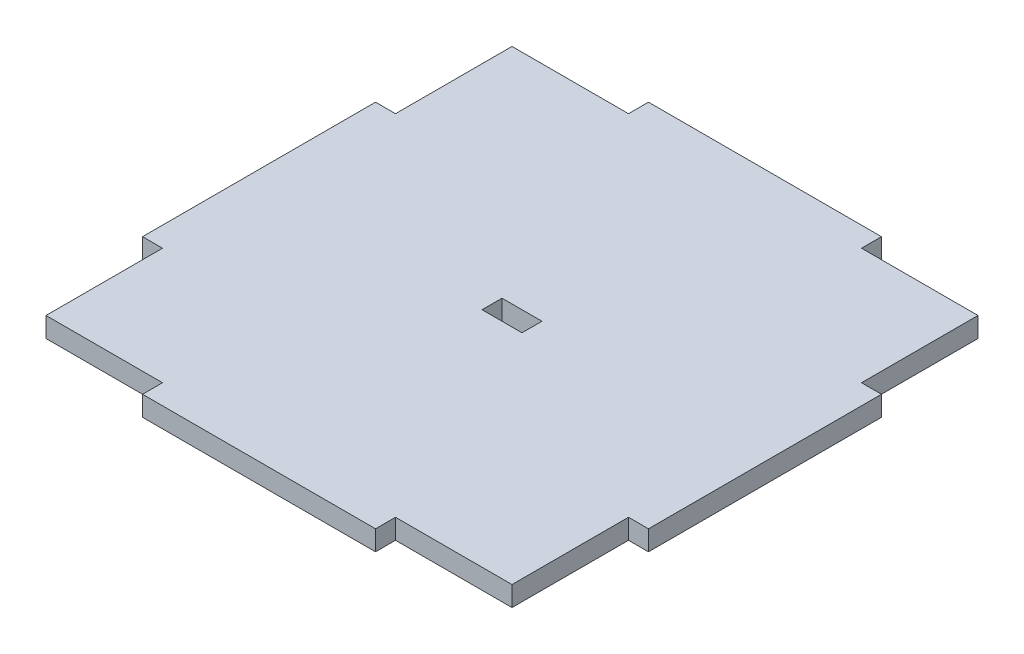
ISO-10303-21;
HEADER;
FILE_DESCRIPTION(('STEP AP214'),'2;1');
FILE_NAME('part.step','',(''),(''),'','','');
FILE_SCHEMA(('AUTOMOTIVE_DESIGN { 1 0 10303 214 1 1 1 1 }'));
ENDSEC;
DATA;
#1=APPLICATION_CONTEXT('core data for automotive mechanical design processes');
#2=APPLICATION_PROTOCOL_DEFINITION('international standard','automotive_design',2000,#1);
#3=PRODUCT_CONTEXT('',#1,'mechanical');
#4=PRODUCT('Part','Part','',(#3));
#5=PRODUCT_RELATED_PRODUCT_CATEGORY('part','',(#4));
#6=PRODUCT_DEFINITION_FORMATION('','',#4);
#7=PRODUCT_DEFINITION_CONTEXT('part definition',#1,'design');
#8=PRODUCT_DEFINITION('design','',#6,#7);
#9=PRODUCT_DEFINITION_SHAPE('','',#8);
#10=(LENGTH_UNIT() NAMED_UNIT(*) SI_UNIT(.MILLI.,.METRE.));
#11=(NAMED_UNIT(*) PLANE_ANGLE_UNIT() SI_UNIT($,.RADIAN.));
#12=(NAMED_UNIT(*) SI_UNIT($,.STERADIAN.) SOLID_ANGLE_UNIT());
#13=UNCERTAINTY_MEASURE_WITH_UNIT(LENGTH_MEASURE(1.E-05),#10,'distance_accuracy_value','');
#14=(GEOMETRIC_REPRESENTATION_CONTEXT(3) GLOBAL_UNCERTAINTY_ASSIGNED_CONTEXT((#13)) GLOBAL_UNIT_ASSIGNED_CONTEXT((#10,
#11,#12)) REPRESENTATION_CONTEXT('',''));
#15=CARTESIAN_POINT('',(0.,0.,0.));
#16=DIRECTION('',(0.,0.,1.));
#17=DIRECTION('',(1.,0.,0.));
#18=AXIS2_PLACEMENT_3D('',#15,#16,#17);
#19=CARTESIAN_POINT('',(35.,3.,-17.5));
#20=DIRECTION('',(-1.,0.,0.));
#21=DIRECTION('',(0.,0.,1.));
#22=AXIS2_PLACEMENT_3D('',#19,#20,#21);
#23=PLANE('',#22);
#24=DIRECTION('',(0.,0.,-1.));
#25=VECTOR('',#24,1.);
#26=CARTESIAN_POINT('',(35.,0.,-17.5));
#27=LINE('',#26,#25);
#28=CARTESIAN_POINT('',(35.,0.,-17.5));
#29=VERTEX_POINT('',#28);
#30=CARTESIAN_POINT('',(35.,0.,-35.));
#31=VERTEX_POINT('',#30);
#32=EDGE_CURVE('E242',#29,#31,#27,.T.);
#33=ORIENTED_EDGE('',*,*,#32,.T.);
#34=DIRECTION('',(0.,-1.,0.));
#35=VECTOR('',#34,1.);
#36=CARTESIAN_POINT('',(35.,3.,-35.));
#37=LINE('',#36,#35);
#38=CARTESIAN_POINT('',(35.,3.,-35.));
#39=VERTEX_POINT('',#38);
#40=EDGE_CURVE('E11',#39,#31,#37,.T.);
#41=ORIENTED_EDGE('',*,*,#40,.F.);
#42=DIRECTION('',(0.,0.,-1.));
#43=VECTOR('',#42,1.);
#44=CARTESIAN_POINT('',(35.,3.,-17.5));
#45=LINE('',#44,#43);
#46=CARTESIAN_POINT('',(35.,3.,-17.5));
#47=VERTEX_POINT('',#46);
#48=EDGE_CURVE('E248',#47,#39,#45,.T.);
#49=ORIENTED_EDGE('',*,*,#48,.F.);
#50=DIRECTION('',(0.,-1.,0.));
#51=VECTOR('',#50,1.);
#52=CARTESIAN_POINT('',(35.,3.,-17.5));
#53=LINE('',#52,#51);
#54=EDGE_CURVE('E310',#47,#29,#53,.T.);
#55=ORIENTED_EDGE('',*,*,#54,.T.);
#56=EDGE_LOOP('',(#33,#41,#49,#55));
#57=FACE_BOUND('',#56,.T.);
#58=ADVANCED_FACE('F38',(#57),#23,.F.);
#59=CARTESIAN_POINT('',(17.5,3.,-35.));
#60=DIRECTION('',(0.,0.,1.));
#61=DIRECTION('',(1.,0.,0.));
#62=AXIS2_PLACEMENT_3D('',#59,#60,#61);
#63=PLANE('',#62);
#64=DIRECTION('',(-1.,0.,0.));
#65=VECTOR('',#64,1.);
#66=CARTESIAN_POINT('',(17.5,0.,-35.));
#67=LINE('',#66,#65);
#68=CARTESIAN_POINT('',(17.5,0.,-35.));
#69=VERTEX_POINT('',#68);
#70=EDGE_CURVE('E314',#31,#69,#67,.T.);
#71=ORIENTED_EDGE('',*,*,#70,.T.);
#72=DIRECTION('',(0.,-1.,0.));
#73=VECTOR('',#72,1.);
#74=CARTESIAN_POINT('',(17.5,3.,-35.));
#75=LINE('',#74,#73);
#76=CARTESIAN_POINT('',(17.5,3.,-35.));
#77=VERTEX_POINT('',#76);
#78=EDGE_CURVE('E46',#77,#69,#75,.T.);
#79=ORIENTED_EDGE('',*,*,#78,.F.);
#80=DIRECTION('',(-1.,0.,0.));
#81=VECTOR('',#80,1.);
#82=CARTESIAN_POINT('',(17.5,3.,-35.));
#83=LINE('',#82,#81);
#84=EDGE_CURVE('E252',#39,#77,#83,.T.);
#85=ORIENTED_EDGE('',*,*,#84,.F.);
#86=ORIENTED_EDGE('',*,*,#40,.T.);
#87=EDGE_LOOP('',(#71,#79,#85,#86));
#88=FACE_BOUND('',#87,.T.);
#89=ADVANCED_FACE('F467',(#88),#63,.F.);
#90=CARTESIAN_POINT('',(17.5,3.,-38.));
#91=DIRECTION('',(-1.,0.,0.));
#92=DIRECTION('',(0.,0.,1.));
#93=AXIS2_PLACEMENT_3D('',#90,#91,#92);
#94=PLANE('',#93);
#95=DIRECTION('',(0.,0.,-1.));
#96=VECTOR('',#95,1.);
#97=CARTESIAN_POINT('',(17.5,0.,-38.));
#98=LINE('',#97,#96);
#99=CARTESIAN_POINT('',(17.5,0.,-38.));
#100=VERTEX_POINT('',#99);
#101=EDGE_CURVE('E317',#69,#100,#98,.T.);
#102=ORIENTED_EDGE('',*,*,#101,.T.);
#103=DIRECTION('',(0.,-1.,0.));
#104=VECTOR('',#103,1.);
#105=CARTESIAN_POINT('',(17.5,3.,-38.));
#106=LINE('',#105,#104);
#107=CARTESIAN_POINT('',(17.5,3.,-38.));
#108=VERTEX_POINT('',#107);
#109=EDGE_CURVE('E437',#108,#100,#106,.T.);
#110=ORIENTED_EDGE('',*,*,#109,.F.);
#111=DIRECTION('',(0.,0.,-1.));
#112=VECTOR('',#111,1.);
#113=CARTESIAN_POINT('',(17.5,3.,-38.));
#114=LINE('',#113,#112);
#115=EDGE_CURVE('E256',#77,#108,#114,.T.);
#116=ORIENTED_EDGE('',*,*,#115,.F.);
#117=ORIENTED_EDGE('',*,*,#78,.T.);
#118=EDGE_LOOP('',(#102,#110,#116,#117));
#119=FACE_BOUND('',#118,.T.);
#120=ADVANCED_FACE('F446',(#119),#94,.F.);
#121=CARTESIAN_POINT('',(-17.5,3.,-38.));
#122=DIRECTION('',(0.,0.,1.));
#123=DIRECTION('',(1.,0.,0.));
#124=AXIS2_PLACEMENT_3D('',#121,#122,#123);
#125=PLANE('',#124);
#126=DIRECTION('',(-1.,0.,0.));
#127=VECTOR('',#126,1.);
#128=CARTESIAN_POINT('',(-17.5,0.,-38.));
#129=LINE('',#128,#127);
#130=CARTESIAN_POINT('',(-17.5,0.,-38.));
#131=VERTEX_POINT('',#130);
#132=EDGE_CURVE('E320',#100,#131,#129,.T.);
#133=ORIENTED_EDGE('',*,*,#132,.T.);
#134=DIRECTION('',(0.,-1.,0.));
#135=VECTOR('',#134,1.);
#136=CARTESIAN_POINT('',(-17.5,3.,-38.));
#137=LINE('',#136,#135);
#138=CARTESIAN_POINT('',(-17.5,3.,-38.));
#139=VERTEX_POINT('',#138);
#140=EDGE_CURVE('E433',#139,#131,#137,.T.);
#141=ORIENTED_EDGE('',*,*,#140,.F.);
#142=DIRECTION('',(-1.,0.,0.));
#143=VECTOR('',#142,1.);
#144=CARTESIAN_POINT('',(-17.5,3.,-38.));
#145=LINE('',#144,#143);
#146=EDGE_CURVE('E259',#108,#139,#145,.T.);
#147=ORIENTED_EDGE('',*,*,#146,.F.);
#148=ORIENTED_EDGE('',*,*,#109,.T.);
#149=EDGE_LOOP('',(#133,#141,#147,#148));
#150=FACE_BOUND('',#149,.T.);
#151=ADVANCED_FACE('F455',(#150),#125,.F.);
#152=CARTESIAN_POINT('',(-17.5,3.,-38.));
#153=DIRECTION('',(1.,0.,0.));
#154=DIRECTION('',(0.,0.,-1.));
#155=AXIS2_PLACEMENT_3D('',#152,#153,#154);
#156=PLANE('',#155);
#157=DIRECTION('',(0.,0.,1.));
#158=VECTOR('',#157,1.);
#159=CARTESIAN_POINT('',(-17.5,0.,-38.));
#160=LINE('',#159,#158);
#161=CARTESIAN_POINT('',(-17.5,0.,-35.));
#162=VERTEX_POINT('',#161);
#163=EDGE_CURVE('E323',#131,#162,#160,.T.);
#164=ORIENTED_EDGE('',*,*,#163,.T.);
#165=DIRECTION('',(0.,-1.,0.));
#166=VECTOR('',#165,1.);
#167=CARTESIAN_POINT('',(-17.5,3.,-35.));
#168=LINE('',#167,#166);
#169=CARTESIAN_POINT('',(-17.5,3.,-35.));
#170=VERTEX_POINT('',#169);
#171=EDGE_CURVE('E429',#170,#162,#168,.T.);
#172=ORIENTED_EDGE('',*,*,#171,.F.);
#173=DIRECTION('',(0.,0.,1.));
#174=VECTOR('',#173,1.);
#175=CARTESIAN_POINT('',(-17.5,3.,-38.));
#176=LINE('',#175,#174);
#177=EDGE_CURVE('E262',#139,#170,#176,.T.);
#178=ORIENTED_EDGE('',*,*,#177,.F.);
#179=ORIENTED_EDGE('',*,*,#140,.T.);
#180=EDGE_LOOP('',(#164,#172,#178,#179));
#181=FACE_BOUND('',#180,.T.);
#182=ADVANCED_FACE('F459',(#181),#156,.F.);
#183=CARTESIAN_POINT('',(-35.,3.,-35.));
#184=DIRECTION('',(0.,0.,1.));
#185=DIRECTION('',(1.,0.,0.));
#186=AXIS2_PLACEMENT_3D('',#183,#184,#185);
#187=PLANE('',#186);
#188=DIRECTION('',(-1.,0.,0.));
#189=VECTOR('',#188,1.);
#190=CARTESIAN_POINT('',(-35.,0.,-35.));
#191=LINE('',#190,#189);
#192=CARTESIAN_POINT('',(-35.,0.,-35.));
#193=VERTEX_POINT('',#192);
#194=EDGE_CURVE('E326',#162,#193,#191,.T.);
#195=ORIENTED_EDGE('',*,*,#194,.T.);
#196=DIRECTION('',(0.,-1.,0.));
#197=VECTOR('',#196,1.);
#198=CARTESIAN_POINT('',(-35.,3.,-35.));
#199=LINE('',#198,#197);
#200=CARTESIAN_POINT('',(-35.,3.,-35.));
#201=VERTEX_POINT('',#200);
#202=EDGE_CURVE('E425',#201,#193,#199,.T.);
#203=ORIENTED_EDGE('',*,*,#202,.F.);
#204=DIRECTION('',(-1.,0.,0.));
#205=VECTOR('',#204,1.);
#206=CARTESIAN_POINT('',(-35.,3.,-35.));
#207=LINE('',#206,#205);
#208=EDGE_CURVE('E265',#170,#201,#207,.T.);
#209=ORIENTED_EDGE('',*,*,#208,.F.);
#210=ORIENTED_EDGE('',*,*,#171,.T.);
#211=EDGE_LOOP('',(#195,#203,#209,#210));
#212=FACE_BOUND('',#211,.T.);
#213=ADVANCED_FACE('F540',(#212),#187,.F.);
#214=CARTESIAN_POINT('',(-35.,3.,-17.5));
#215=DIRECTION('',(1.,0.,0.));
#216=DIRECTION('',(0.,0.,-1.));
#217=AXIS2_PLACEMENT_3D('',#214,#215,#216);
#218=PLANE('',#217);
#219=DIRECTION('',(0.,0.,1.));
#220=VECTOR('',#219,1.);
#221=CARTESIAN_POINT('',(-35.,0.,-17.5));
#222=LINE('',#221,#220);
#223=CARTESIAN_POINT('',(-35.,0.,-17.5));
#224=VERTEX_POINT('',#223);
#225=EDGE_CURVE('E329',#193,#224,#222,.T.);
#226=ORIENTED_EDGE('',*,*,#225,.T.);
#227=DIRECTION('',(0.,-1.,0.));
#228=VECTOR('',#227,1.);
#229=CARTESIAN_POINT('',(-35.,3.,-17.5));
#230=LINE('',#229,#228);
#231=CARTESIAN_POINT('',(-35.,3.,-17.5));
#232=VERTEX_POINT('',#231);
#233=EDGE_CURVE('E421',#232,#224,#230,.T.);
#234=ORIENTED_EDGE('',*,*,#233,.F.);
#235=DIRECTION('',(0.,0.,1.));
#236=VECTOR('',#235,1.);
#237=CARTESIAN_POINT('',(-35.,3.,-17.5));
#238=LINE('',#237,#236);
#239=EDGE_CURVE('E268',#201,#232,#238,.T.);
#240=ORIENTED_EDGE('',*,*,#239,.F.);
#241=ORIENTED_EDGE('',*,*,#202,.T.);
#242=EDGE_LOOP('',(#226,#234,#240,#241));
#243=FACE_BOUND('',#242,.T.);
#244=ADVANCED_FACE('F538',(#243),#218,.F.);
#245=CARTESIAN_POINT('',(-38.,3.,-17.5));
#246=DIRECTION('',(0.,0.,1.));
#247=DIRECTION('',(1.,0.,0.));
#248=AXIS2_PLACEMENT_3D('',#245,#246,#247);
#249=PLANE('',#248);
#250=DIRECTION('',(-1.,0.,0.));
#251=VECTOR('',#250,1.);
#252=CARTESIAN_POINT('',(-38.,0.,-17.5));
#253=LINE('',#252,#251);
#254=CARTESIAN_POINT('',(-38.,0.,-17.5));
#255=VERTEX_POINT('',#254);
#256=EDGE_CURVE('E332',#224,#255,#253,.T.);
#257=ORIENTED_EDGE('',*,*,#256,.T.);
#258=DIRECTION('',(0.,-1.,0.));
#259=VECTOR('',#258,1.);
#260=CARTESIAN_POINT('',(-38.,3.,-17.5));
#261=LINE('',#260,#259);
#262=CARTESIAN_POINT('',(-38.,3.,-17.5));
#263=VERTEX_POINT('',#262);
#264=EDGE_CURVE('E417',#263,#255,#261,.T.);
#265=ORIENTED_EDGE('',*,*,#264,.F.);
#266=DIRECTION('',(-1.,0.,0.));
#267=VECTOR('',#266,1.);
#268=CARTESIAN_POINT('',(-38.,3.,-17.5));
#269=LINE('',#268,#267);
#270=EDGE_CURVE('E271',#232,#263,#269,.T.);
#271=ORIENTED_EDGE('',*,*,#270,.F.);
#272=ORIENTED_EDGE('',*,*,#233,.T.);
#273=EDGE_LOOP('',(#257,#265,#271,#272));
#274=FACE_BOUND('',#273,.T.);
#275=ADVANCED_FACE('F533',(#274),#249,.F.);
#276=CARTESIAN_POINT('',(-38.,3.,17.5));
#277=DIRECTION('',(1.,0.,0.));
#278=DIRECTION('',(0.,0.,-1.));
#279=AXIS2_PLACEMENT_3D('',#276,#277,#278);
#280=PLANE('',#279);
#281=DIRECTION('',(0.,0.,1.));
#282=VECTOR('',#281,1.);
#283=CARTESIAN_POINT('',(-38.,0.,17.5));
#284=LINE('',#283,#282);
#285=CARTESIAN_POINT('',(-38.,0.,17.5));
#286=VERTEX_POINT('',#285);
#287=EDGE_CURVE('E335',#255,#286,#284,.T.);
#288=ORIENTED_EDGE('',*,*,#287,.T.);
#289=DIRECTION('',(0.,-1.,0.));
#290=VECTOR('',#289,1.);
#291=CARTESIAN_POINT('',(-38.,3.,17.5));
#292=LINE('',#291,#290);
#293=CARTESIAN_POINT('',(-38.,3.,17.5));
#294=VERTEX_POINT('',#293);
#295=EDGE_CURVE('E413',#294,#286,#292,.T.);
#296=ORIENTED_EDGE('',*,*,#295,.F.);
#297=DIRECTION('',(0.,0.,1.));
#298=VECTOR('',#297,1.);
#299=CARTESIAN_POINT('',(-38.,3.,17.5));
#300=LINE('',#299,#298);
#301=EDGE_CURVE('E274',#263,#294,#300,.T.);
#302=ORIENTED_EDGE('',*,*,#301,.F.);
#303=ORIENTED_EDGE('',*,*,#264,.T.);
#304=EDGE_LOOP('',(#288,#296,#302,#303));
#305=FACE_BOUND('',#304,.T.);
#306=ADVANCED_FACE('F528',(#305),#280,.F.);
#307=CARTESIAN_POINT('',(-38.,3.,17.5));
#308=DIRECTION('',(0.,0.,-1.));
#309=DIRECTION('',(-1.,0.,0.));
#310=AXIS2_PLACEMENT_3D('',#307,#308,#309);
#311=PLANE('',#310);
#312=DIRECTION('',(1.,0.,0.));
#313=VECTOR('',#312,1.);
#314=CARTESIAN_POINT('',(-38.,0.,17.5));
#315=LINE('',#314,#313);
#316=CARTESIAN_POINT('',(-35.,0.,17.5));
#317=VERTEX_POINT('',#316);
#318=EDGE_CURVE('E338',#286,#317,#315,.T.);
#319=ORIENTED_EDGE('',*,*,#318,.T.);
#320=DIRECTION('',(0.,-1.,0.));
#321=VECTOR('',#320,1.);
#322=CARTESIAN_POINT('',(-35.,3.,17.5));
#323=LINE('',#322,#321);
#324=CARTESIAN_POINT('',(-35.,3.,17.5));
#325=VERTEX_POINT('',#324);
#326=EDGE_CURVE('E409',#325,#317,#323,.T.);
#327=ORIENTED_EDGE('',*,*,#326,.F.);
#328=DIRECTION('',(1.,0.,0.));
#329=VECTOR('',#328,1.);
#330=CARTESIAN_POINT('',(-38.,3.,17.5));
#331=LINE('',#330,#329);
#332=EDGE_CURVE('E277',#294,#325,#331,.T.);
#333=ORIENTED_EDGE('',*,*,#332,.F.);
#334=ORIENTED_EDGE('',*,*,#295,.T.);
#335=EDGE_LOOP('',(#319,#327,#333,#334));
#336=FACE_BOUND('',#335,.T.);
#337=ADVANCED_FACE('F524',(#336),#311,.F.);
#338=CARTESIAN_POINT('',(-35.,3.,35.));
#339=DIRECTION('',(1.,0.,0.));
#340=DIRECTION('',(0.,0.,-1.));
#341=AXIS2_PLACEMENT_3D('',#338,#339,#340);
#342=PLANE('',#341);
#343=DIRECTION('',(0.,0.,1.));
#344=VECTOR('',#343,1.);
#345=CARTESIAN_POINT('',(-35.,0.,35.));
#346=LINE('',#345,#344);
#347=CARTESIAN_POINT('',(-35.,0.,35.));
#348=VERTEX_POINT('',#347);
#349=EDGE_CURVE('E341',#317,#348,#346,.T.);
#350=ORIENTED_EDGE('',*,*,#349,.T.);
#351=DIRECTION('',(0.,-1.,0.));
#352=VECTOR('',#351,1.);
#353=CARTESIAN_POINT('',(-35.,3.,35.));
#354=LINE('',#353,#352);
#355=CARTESIAN_POINT('',(-35.,3.,35.));
#356=VERTEX_POINT('',#355);
#357=EDGE_CURVE('E405',#356,#348,#354,.T.);
#358=ORIENTED_EDGE('',*,*,#357,.F.);
#359=DIRECTION('',(0.,0.,1.));
#360=VECTOR('',#359,1.);
#361=CARTESIAN_POINT('',(-35.,3.,35.));
#362=LINE('',#361,#360);
#363=EDGE_CURVE('E280',#325,#356,#362,.T.);
#364=ORIENTED_EDGE('',*,*,#363,.F.);
#365=ORIENTED_EDGE('',*,*,#326,.T.);
#366=EDGE_LOOP('',(#350,#358,#364,#365));
#367=FACE_BOUND('',#366,.T.);
#368=ADVANCED_FACE('F519',(#367),#342,.F.);
#369=CARTESIAN_POINT('',(-35.,3.,35.));
#370=DIRECTION('',(0.,0.,-1.));
#371=DIRECTION('',(-1.,0.,0.));
#372=AXIS2_PLACEMENT_3D('',#369,#370,#371);
#373=PLANE('',#372);
#374=DIRECTION('',(1.,0.,0.));
#375=VECTOR('',#374,1.);
#376=CARTESIAN_POINT('',(-35.,0.,35.));
#377=LINE('',#376,#375);
#378=CARTESIAN_POINT('',(-17.5,0.,35.));
#379=VERTEX_POINT('',#378);
#380=EDGE_CURVE('E344',#348,#379,#377,.T.);
#381=ORIENTED_EDGE('',*,*,#380,.T.);
#382=DIRECTION('',(0.,-1.,0.));
#383=VECTOR('',#382,1.);
#384=CARTESIAN_POINT('',(-17.5,3.,35.));
#385=LINE('',#384,#383);
#386=CARTESIAN_POINT('',(-17.5,3.,35.));
#387=VERTEX_POINT('',#386);
#388=EDGE_CURVE('E401',#387,#379,#385,.T.);
#389=ORIENTED_EDGE('',*,*,#388,.F.);
#390=DIRECTION('',(1.,0.,0.));
#391=VECTOR('',#390,1.);
#392=CARTESIAN_POINT('',(-35.,3.,35.));
#393=LINE('',#392,#391);
#394=EDGE_CURVE('E283',#356,#387,#393,.T.);
#395=ORIENTED_EDGE('',*,*,#394,.F.);
#396=ORIENTED_EDGE('',*,*,#357,.T.);
#397=EDGE_LOOP('',(#381,#389,#395,#396));
#398=FACE_BOUND('',#397,.T.);
#399=ADVANCED_FACE('F513',(#398),#373,.F.);
#400=CARTESIAN_POINT('',(-17.5,3.,38.));
#401=DIRECTION('',(1.,0.,0.));
#402=DIRECTION('',(0.,0.,-1.));
#403=AXIS2_PLACEMENT_3D('',#400,#401,#402);
#404=PLANE('',#403);
#405=DIRECTION('',(0.,0.,1.));
#406=VECTOR('',#405,1.);
#407=CARTESIAN_POINT('',(-17.5,0.,38.));
#408=LINE('',#407,#406);
#409=CARTESIAN_POINT('',(-17.5,0.,38.));
#410=VERTEX_POINT('',#409);
#411=EDGE_CURVE('E347',#379,#410,#408,.T.);
#412=ORIENTED_EDGE('',*,*,#411,.T.);
#413=DIRECTION('',(0.,-1.,0.));
#414=VECTOR('',#413,1.);
#415=CARTESIAN_POINT('',(-17.5,3.,38.));
#416=LINE('',#415,#414);
#417=CARTESIAN_POINT('',(-17.5,3.,38.));
#418=VERTEX_POINT('',#417);
#419=EDGE_CURVE('E397',#418,#410,#416,.T.);
#420=ORIENTED_EDGE('',*,*,#419,.F.);
#421=DIRECTION('',(0.,0.,1.));
#422=VECTOR('',#421,1.);
#423=CARTESIAN_POINT('',(-17.5,3.,38.));
#424=LINE('',#423,#422);
#425=EDGE_CURVE('E286',#387,#418,#424,.T.);
#426=ORIENTED_EDGE('',*,*,#425,.F.);
#427=ORIENTED_EDGE('',*,*,#388,.T.);
#428=EDGE_LOOP('',(#412,#420,#426,#427));
#429=FACE_BOUND('',#428,.T.);
#430=ADVANCED_FACE('F509',(#429),#404,.F.);
#431=CARTESIAN_POINT('',(-17.5,3.,38.));
#432=DIRECTION('',(0.,0.,-1.));
#433=DIRECTION('',(-1.,0.,0.));
#434=AXIS2_PLACEMENT_3D('',#431,#432,#433);
#435=PLANE('',#434);
#436=DIRECTION('',(1.,0.,0.));
#437=VECTOR('',#436,1.);
#438=CARTESIAN_POINT('',(-17.5,0.,38.));
#439=LINE('',#438,#437);
#440=CARTESIAN_POINT('',(17.5,0.,38.));
#441=VERTEX_POINT('',#440);
#442=EDGE_CURVE('E350',#410,#441,#439,.T.);
#443=ORIENTED_EDGE('',*,*,#442,.T.);
#444=DIRECTION('',(0.,-1.,0.));
#445=VECTOR('',#444,1.);
#446=CARTESIAN_POINT('',(17.5,3.,38.));
#447=LINE('',#446,#445);
#448=CARTESIAN_POINT('',(17.5,3.,38.));
#449=VERTEX_POINT('',#448);
#450=EDGE_CURVE('E393',#449,#441,#447,.T.);
#451=ORIENTED_EDGE('',*,*,#450,.F.);
#452=DIRECTION('',(1.,0.,0.));
#453=VECTOR('',#452,1.);
#454=CARTESIAN_POINT('',(-17.5,3.,38.));
#455=LINE('',#454,#453);
#456=EDGE_CURVE('E289',#418,#449,#455,.T.);
#457=ORIENTED_EDGE('',*,*,#456,.F.);
#458=ORIENTED_EDGE('',*,*,#419,.T.);
#459=EDGE_LOOP('',(#443,#451,#457,#458));
#460=FACE_BOUND('',#459,.T.);
#461=ADVANCED_FACE('F504',(#460),#435,.F.);
#462=CARTESIAN_POINT('',(17.5,3.,38.));
#463=DIRECTION('',(-1.,0.,0.));
#464=DIRECTION('',(0.,0.,1.));
#465=AXIS2_PLACEMENT_3D('',#462,#463,#464);
#466=PLANE('',#465);
#467=DIRECTION('',(0.,0.,-1.));
#468=VECTOR('',#467,1.);
#469=CARTESIAN_POINT('',(17.5,0.,38.));
#470=LINE('',#469,#468);
#471=CARTESIAN_POINT('',(17.5,0.,35.));
#472=VERTEX_POINT('',#471);
#473=EDGE_CURVE('E353',#441,#472,#470,.T.);
#474=ORIENTED_EDGE('',*,*,#473,.T.);
#475=DIRECTION('',(0.,-1.,0.));
#476=VECTOR('',#475,1.);
#477=CARTESIAN_POINT('',(17.5,3.,35.));
#478=LINE('',#477,#476);
#479=CARTESIAN_POINT('',(17.5,3.,35.));
#480=VERTEX_POINT('',#479);
#481=EDGE_CURVE('E389',#480,#472,#478,.T.);
#482=ORIENTED_EDGE('',*,*,#481,.F.);
#483=DIRECTION('',(0.,0.,-1.));
#484=VECTOR('',#483,1.);
#485=CARTESIAN_POINT('',(17.5,3.,38.));
#486=LINE('',#485,#484);
#487=EDGE_CURVE('E292',#449,#480,#486,.T.);
#488=ORIENTED_EDGE('',*,*,#487,.F.);
#489=ORIENTED_EDGE('',*,*,#450,.T.);
#490=EDGE_LOOP('',(#474,#482,#488,#489));
#491=FACE_BOUND('',#490,.T.);
#492=ADVANCED_FACE('F498',(#491),#466,.F.);
#493=CARTESIAN_POINT('',(17.5,3.,35.));
#494=DIRECTION('',(0.,0.,-1.));
#495=DIRECTION('',(-1.,0.,0.));
#496=AXIS2_PLACEMENT_3D('',#493,#494,#495);
#497=PLANE('',#496);
#498=DIRECTION('',(1.,0.,0.));
#499=VECTOR('',#498,1.);
#500=CARTESIAN_POINT('',(17.5,0.,35.));
#501=LINE('',#500,#499);
#502=CARTESIAN_POINT('',(35.,0.,35.));
#503=VERTEX_POINT('',#502);
#504=EDGE_CURVE('E356',#472,#503,#501,.T.);
#505=ORIENTED_EDGE('',*,*,#504,.T.);
#506=DIRECTION('',(0.,-1.,0.));
#507=VECTOR('',#506,1.);
#508=CARTESIAN_POINT('',(35.,3.,35.));
#509=LINE('',#508,#507);
#510=CARTESIAN_POINT('',(35.,3.,35.));
#511=VERTEX_POINT('',#510);
#512=EDGE_CURVE('E385',#511,#503,#509,.T.);
#513=ORIENTED_EDGE('',*,*,#512,.F.);
#514=DIRECTION('',(1.,0.,0.));
#515=VECTOR('',#514,1.);
#516=CARTESIAN_POINT('',(17.5,3.,35.));
#517=LINE('',#516,#515);
#518=EDGE_CURVE('E295',#480,#511,#517,.T.);
#519=ORIENTED_EDGE('',*,*,#518,.F.);
#520=ORIENTED_EDGE('',*,*,#481,.T.);
#521=EDGE_LOOP('',(#505,#513,#519,#520));
#522=FACE_BOUND('',#521,.T.);
#523=ADVANCED_FACE('F494',(#522),#497,.F.);
#524=CARTESIAN_POINT('',(35.,3.,35.));
#525=DIRECTION('',(-1.,0.,0.));
#526=DIRECTION('',(0.,0.,1.));
#527=AXIS2_PLACEMENT_3D('',#524,#525,#526);
#528=PLANE('',#527);
#529=DIRECTION('',(0.,0.,-1.));
#530=VECTOR('',#529,1.);
#531=CARTESIAN_POINT('',(35.,0.,35.));
#532=LINE('',#531,#530);
#533=CARTESIAN_POINT('',(35.,0.,17.5));
#534=VERTEX_POINT('',#533);
#535=EDGE_CURVE('E359',#503,#534,#532,.T.);
#536=ORIENTED_EDGE('',*,*,#535,.T.);
#537=DIRECTION('',(0.,-1.,0.));
#538=VECTOR('',#537,1.);
#539=CARTESIAN_POINT('',(35.,3.,17.5));
#540=LINE('',#539,#538);
#541=CARTESIAN_POINT('',(35.,3.,17.5));
#542=VERTEX_POINT('',#541);
#543=EDGE_CURVE('E381',#542,#534,#540,.T.);
#544=ORIENTED_EDGE('',*,*,#543,.F.);
#545=DIRECTION('',(0.,0.,-1.));
#546=VECTOR('',#545,1.);
#547=CARTESIAN_POINT('',(35.,3.,35.));
#548=LINE('',#547,#546);
#549=EDGE_CURVE('E298',#511,#542,#548,.T.);
#550=ORIENTED_EDGE('',*,*,#549,.F.);
#551=ORIENTED_EDGE('',*,*,#512,.T.);
#552=EDGE_LOOP('',(#536,#544,#550,#551));
#553=FACE_BOUND('',#552,.T.);
#554=ADVANCED_FACE('F489',(#553),#528,.F.);
#555=CARTESIAN_POINT('',(38.,3.,17.5));
#556=DIRECTION('',(0.,0.,-1.));
#557=DIRECTION('',(-1.,0.,0.));
#558=AXIS2_PLACEMENT_3D('',#555,#556,#557);
#559=PLANE('',#558);
#560=DIRECTION('',(1.,0.,0.));
#561=VECTOR('',#560,1.);
#562=CARTESIAN_POINT('',(38.,0.,17.5));
#563=LINE('',#562,#561);
#564=CARTESIAN_POINT('',(38.,0.,17.5));
#565=VERTEX_POINT('',#564);
#566=EDGE_CURVE('E362',#534,#565,#563,.T.);
#567=ORIENTED_EDGE('',*,*,#566,.T.);
#568=DIRECTION('',(0.,-1.,0.));
#569=VECTOR('',#568,1.);
#570=CARTESIAN_POINT('',(38.,3.,17.5));
#571=LINE('',#570,#569);
#572=CARTESIAN_POINT('',(38.,3.,17.5));
#573=VERTEX_POINT('',#572);
#574=EDGE_CURVE('E377',#573,#565,#571,.T.);
#575=ORIENTED_EDGE('',*,*,#574,.F.);
#576=DIRECTION('',(1.,0.,0.));
#577=VECTOR('',#576,1.);
#578=CARTESIAN_POINT('',(38.,3.,17.5));
#579=LINE('',#578,#577);
#580=EDGE_CURVE('E301',#542,#573,#579,.T.);
#581=ORIENTED_EDGE('',*,*,#580,.F.);
#582=ORIENTED_EDGE('',*,*,#543,.T.);
#583=EDGE_LOOP('',(#567,#575,#581,#582));
#584=FACE_BOUND('',#583,.T.);
#585=ADVANCED_FACE('F483',(#584),#559,.F.);
#586=CARTESIAN_POINT('',(38.,3.,-17.5));
#587=DIRECTION('',(-1.,0.,0.));
#588=DIRECTION('',(0.,0.,1.));
#589=AXIS2_PLACEMENT_3D('',#586,#587,#588);
#590=PLANE('',#589);
#591=DIRECTION('',(0.,0.,-1.));
#592=VECTOR('',#591,1.);
#593=CARTESIAN_POINT('',(38.,0.,-17.5));
#594=LINE('',#593,#592);
#595=CARTESIAN_POINT('',(38.,0.,-17.5));
#596=VERTEX_POINT('',#595);
#597=EDGE_CURVE('E365',#565,#596,#594,.T.);
#598=ORIENTED_EDGE('',*,*,#597,.T.);
#599=DIRECTION('',(0.,-1.,0.));
#600=VECTOR('',#599,1.);
#601=CARTESIAN_POINT('',(38.,3.,-17.5));
#602=LINE('',#601,#600);
#603=CARTESIAN_POINT('',(38.,3.,-17.5));
#604=VERTEX_POINT('',#603);
#605=EDGE_CURVE('E373',#604,#596,#602,.T.);
#606=ORIENTED_EDGE('',*,*,#605,.F.);
#607=DIRECTION('',(0.,0.,-1.));
#608=VECTOR('',#607,1.);
#609=CARTESIAN_POINT('',(38.,3.,-17.5));
#610=LINE('',#609,#608);
#611=EDGE_CURVE('E304',#573,#604,#610,.T.);
#612=ORIENTED_EDGE('',*,*,#611,.F.);
#613=ORIENTED_EDGE('',*,*,#574,.T.);
#614=EDGE_LOOP('',(#598,#606,#612,#613));
#615=FACE_BOUND('',#614,.T.);
#616=ADVANCED_FACE('F479',(#615),#590,.F.);
#617=CARTESIAN_POINT('',(38.,3.,-17.5));
#618=DIRECTION('',(0.,0.,1.));
#619=DIRECTION('',(1.,0.,0.));
#620=AXIS2_PLACEMENT_3D('',#617,#618,#619);
#621=PLANE('',#620);
#622=DIRECTION('',(-1.,0.,0.));
#623=VECTOR('',#622,1.);
#624=CARTESIAN_POINT('',(38.,0.,-17.5));
#625=LINE('',#624,#623);
#626=EDGE_CURVE('E253',#596,#29,#625,.T.);
#627=ORIENTED_EDGE('',*,*,#626,.T.);
#628=ORIENTED_EDGE('',*,*,#54,.F.);
#629=DIRECTION('',(-1.,0.,0.));
#630=VECTOR('',#629,1.);
#631=CARTESIAN_POINT('',(38.,3.,-17.5));
#632=LINE('',#631,#630);
#633=EDGE_CURVE('E307',#604,#47,#632,.T.);
#634=ORIENTED_EDGE('',*,*,#633,.F.);
#635=ORIENTED_EDGE('',*,*,#605,.T.);
#636=EDGE_LOOP('',(#627,#628,#634,#635));
#637=FACE_BOUND('',#636,.T.);
#638=ADVANCED_FACE('F474',(#637),#621,.F.);
#639=CARTESIAN_POINT('',(0.,3.,0.));
#640=DIRECTION('',(0.,-1.,0.));
#641=DIRECTION('',(0.,0.,-1.));
#642=AXIS2_PLACEMENT_3D('',#639,#640,#641);
#643=PLANE('',#642);
#644=DIRECTION('',(-1.,0.,0.));
#645=VECTOR('',#644,1.);
#646=CARTESIAN_POINT('',(-3.,3.,-1.5));
#647=LINE('',#646,#645);
#648=CARTESIAN_POINT('',(3.,3.,-1.5));
#649=VERTEX_POINT('',#648);
#650=CARTESIAN_POINT('',(-3.,3.,-1.5));
#651=VERTEX_POINT('',#650);
#652=EDGE_CURVE('E233',#649,#651,#647,.T.);
#653=ORIENTED_EDGE('',*,*,#652,.F.);
#654=DIRECTION('',(0.,0.,-1.));
#655=VECTOR('',#654,1.);
#656=CARTESIAN_POINT('',(3.,3.,1.5));
#657=LINE('',#656,#655);
#658=CARTESIAN_POINT('',(3.,3.,1.5));
#659=VERTEX_POINT('',#658);
#660=EDGE_CURVE('E53',#659,#649,#657,.T.);
#661=ORIENTED_EDGE('',*,*,#660,.F.);
#662=DIRECTION('',(1.,0.,0.));
#663=VECTOR('',#662,1.);
#664=CARTESIAN_POINT('',(-3.,3.,1.5));
#665=LINE('',#664,#663);
#666=CARTESIAN_POINT('',(-3.,3.,1.5));
#667=VERTEX_POINT('',#666);
#668=EDGE_CURVE('E220',#667,#659,#665,.T.);
#669=ORIENTED_EDGE('',*,*,#668,.F.);
#670=DIRECTION('',(0.,0.,1.));
#671=VECTOR('',#670,1.);
#672=CARTESIAN_POINT('',(-3.,3.,1.5));
#673=LINE('',#672,#671);
#674=EDGE_CURVE('E224',#651,#667,#673,.T.);
#675=ORIENTED_EDGE('',*,*,#674,.F.);
#676=EDGE_LOOP('',(#653,#661,#669,#675));
#677=FACE_BOUND('',#676,.T.);
#678=ORIENTED_EDGE('',*,*,#48,.T.);
#679=ORIENTED_EDGE('',*,*,#84,.T.);
#680=ORIENTED_EDGE('',*,*,#115,.T.);
#681=ORIENTED_EDGE('',*,*,#146,.T.);
#682=ORIENTED_EDGE('',*,*,#177,.T.);
#683=ORIENTED_EDGE('',*,*,#208,.T.);
#684=ORIENTED_EDGE('',*,*,#239,.T.);
#685=ORIENTED_EDGE('',*,*,#270,.T.);
#686=ORIENTED_EDGE('',*,*,#301,.T.);
#687=ORIENTED_EDGE('',*,*,#332,.T.);
#688=ORIENTED_EDGE('',*,*,#363,.T.);
#689=ORIENTED_EDGE('',*,*,#394,.T.);
#690=ORIENTED_EDGE('',*,*,#425,.T.);
#691=ORIENTED_EDGE('',*,*,#456,.T.);
#692=ORIENTED_EDGE('',*,*,#487,.T.);
#693=ORIENTED_EDGE('',*,*,#518,.T.);
#694=ORIENTED_EDGE('',*,*,#549,.T.);
#695=ORIENTED_EDGE('',*,*,#580,.T.);
#696=ORIENTED_EDGE('',*,*,#611,.T.);
#697=ORIENTED_EDGE('',*,*,#633,.T.);
#698=EDGE_LOOP('',(#678,#679,#680,#681,#682,#683,#684,#685,#686,#687,#688,#689,#690,#691,#692,
#693,#694,#695,#696,#697));
#699=FACE_BOUND('',#698,.T.);
#700=ADVANCED_FACE('F463',(#677,#699),#643,.F.);
#701=CARTESIAN_POINT('',(0.,0.,0.));
#702=DIRECTION('',(0.,-1.,0.));
#703=DIRECTION('',(0.,0.,-1.));
#704=AXIS2_PLACEMENT_3D('',#701,#702,#703);
#705=PLANE('',#704);
#706=DIRECTION('',(0.,0.,-1.));
#707=VECTOR('',#706,1.);
#708=CARTESIAN_POINT('',(3.,0.,1.5));
#709=LINE('',#708,#707);
#710=CARTESIAN_POINT('',(3.,0.,1.5));
#711=VERTEX_POINT('',#710);
#712=CARTESIAN_POINT('',(3.,0.,-1.5));
#713=VERTEX_POINT('',#712);
#714=EDGE_CURVE('E201',#711,#713,#709,.T.);
#715=ORIENTED_EDGE('',*,*,#714,.T.);
#716=DIRECTION('',(-1.,0.,0.));
#717=VECTOR('',#716,1.);
#718=CARTESIAN_POINT('',(-3.,0.,-1.5));
#719=LINE('',#718,#717);
#720=CARTESIAN_POINT('',(-3.,0.,-1.5));
#721=VERTEX_POINT('',#720);
#722=EDGE_CURVE('E211',#713,#721,#719,.T.);
#723=ORIENTED_EDGE('',*,*,#722,.T.);
#724=DIRECTION('',(0.,0.,1.));
#725=VECTOR('',#724,1.);
#726=CARTESIAN_POINT('',(-3.,0.,1.5));
#727=LINE('',#726,#725);
#728=CARTESIAN_POINT('',(-3.,0.,1.5));
#729=VERTEX_POINT('',#728);
#730=EDGE_CURVE('E61',#721,#729,#727,.T.);
#731=ORIENTED_EDGE('',*,*,#730,.T.);
#732=DIRECTION('',(1.,0.,0.));
#733=VECTOR('',#732,1.);
#734=CARTESIAN_POINT('',(-3.,0.,1.5));
#735=LINE('',#734,#733);
#736=EDGE_CURVE('E208',#729,#711,#735,.T.);
#737=ORIENTED_EDGE('',*,*,#736,.T.);
#738=EDGE_LOOP('',(#715,#723,#731,#737));
#739=FACE_BOUND('',#738,.T.);
#740=ORIENTED_EDGE('',*,*,#32,.F.);
#741=ORIENTED_EDGE('',*,*,#626,.F.);
#742=ORIENTED_EDGE('',*,*,#597,.F.);
#743=ORIENTED_EDGE('',*,*,#566,.F.);
#744=ORIENTED_EDGE('',*,*,#535,.F.);
#745=ORIENTED_EDGE('',*,*,#504,.F.);
#746=ORIENTED_EDGE('',*,*,#473,.F.);
#747=ORIENTED_EDGE('',*,*,#442,.F.);
#748=ORIENTED_EDGE('',*,*,#411,.F.);
#749=ORIENTED_EDGE('',*,*,#380,.F.);
#750=ORIENTED_EDGE('',*,*,#349,.F.);
#751=ORIENTED_EDGE('',*,*,#318,.F.);
#752=ORIENTED_EDGE('',*,*,#287,.F.);
#753=ORIENTED_EDGE('',*,*,#256,.F.);
#754=ORIENTED_EDGE('',*,*,#225,.F.);
#755=ORIENTED_EDGE('',*,*,#194,.F.);
#756=ORIENTED_EDGE('',*,*,#163,.F.);
#757=ORIENTED_EDGE('',*,*,#132,.F.);
#758=ORIENTED_EDGE('',*,*,#101,.F.);
#759=ORIENTED_EDGE('',*,*,#70,.F.);
#760=EDGE_LOOP('',(#740,#741,#742,#743,#744,#745,#746,#747,#748,#749,#750,#751,#752,#753,#754,
#755,#756,#757,#758,#759));
#761=FACE_BOUND('',#760,.T.);
#762=ADVANCED_FACE('F216',(#739,#761),#705,.T.);
#763=CARTESIAN_POINT('',(3.,0.,1.5));
#764=DIRECTION('',(1.,0.,0.));
#765=DIRECTION('',(0.,0.,-1.));
#766=AXIS2_PLACEMENT_3D('',#763,#764,#765);
#767=PLANE('',#766);
#768=ORIENTED_EDGE('',*,*,#660,.T.);
#769=DIRECTION('',(0.,1.,0.));
#770=VECTOR('',#769,1.);
#771=CARTESIAN_POINT('',(3.,0.,-1.5));
#772=LINE('',#771,#770);
#773=EDGE_CURVE('E197',#713,#649,#772,.T.);
#774=ORIENTED_EDGE('',*,*,#773,.F.);
#775=ORIENTED_EDGE('',*,*,#714,.F.);
#776=DIRECTION('',(0.,1.,0.));
#777=VECTOR('',#776,1.);
#778=CARTESIAN_POINT('',(3.,0.,1.5));
#779=LINE('',#778,#777);
#780=EDGE_CURVE('E239',#711,#659,#779,.T.);
#781=ORIENTED_EDGE('',*,*,#780,.T.);
#782=EDGE_LOOP('',(#768,#774,#775,#781));
#783=FACE_BOUND('',#782,.T.);
#784=ADVANCED_FACE('F199',(#783),#767,.F.);
#785=CARTESIAN_POINT('',(-3.,0.,1.5));
#786=DIRECTION('',(0.,0.,1.));
#787=DIRECTION('',(1.,0.,0.));
#788=AXIS2_PLACEMENT_3D('',#785,#786,#787);
#789=PLANE('',#788);
#790=ORIENTED_EDGE('',*,*,#668,.T.);
#791=ORIENTED_EDGE('',*,*,#780,.F.);
#792=ORIENTED_EDGE('',*,*,#736,.F.);
#793=DIRECTION('',(0.,1.,0.));
#794=VECTOR('',#793,1.);
#795=CARTESIAN_POINT('',(-3.,0.,1.5));
#796=LINE('',#795,#794);
#797=EDGE_CURVE('E243',#729,#667,#796,.T.);
#798=ORIENTED_EDGE('',*,*,#797,.T.);
#799=EDGE_LOOP('',(#790,#791,#792,#798));
#800=FACE_BOUND('',#799,.T.);
#801=ADVANCED_FACE('F703',(#800),#789,.F.);
#802=CARTESIAN_POINT('',(-3.,0.,1.5));
#803=DIRECTION('',(-1.,0.,0.));
#804=DIRECTION('',(0.,0.,1.));
#805=AXIS2_PLACEMENT_3D('',#802,#803,#804);
#806=PLANE('',#805);
#807=ORIENTED_EDGE('',*,*,#674,.T.);
#808=ORIENTED_EDGE('',*,*,#797,.F.);
#809=ORIENTED_EDGE('',*,*,#730,.F.);
#810=DIRECTION('',(0.,1.,0.));
#811=VECTOR('',#810,1.);
#812=CARTESIAN_POINT('',(-3.,0.,-1.5));
#813=LINE('',#812,#811);
#814=EDGE_CURVE('E207',#721,#651,#813,.T.);
#815=ORIENTED_EDGE('',*,*,#814,.T.);
#816=EDGE_LOOP('',(#807,#808,#809,#815));
#817=FACE_BOUND('',#816,.T.);
#818=ADVANCED_FACE('F712',(#817),#806,.F.);
#819=CARTESIAN_POINT('',(-3.,0.,-1.5));
#820=DIRECTION('',(0.,0.,-1.));
#821=DIRECTION('',(-1.,0.,0.));
#822=AXIS2_PLACEMENT_3D('',#819,#820,#821);
#823=PLANE('',#822);
#824=ORIENTED_EDGE('',*,*,#652,.T.);
#825=ORIENTED_EDGE('',*,*,#814,.F.);
#826=ORIENTED_EDGE('',*,*,#722,.F.);
#827=ORIENTED_EDGE('',*,*,#773,.T.);
#828=EDGE_LOOP('',(#824,#825,#826,#827));
#829=FACE_BOUND('',#828,.T.);
#830=ADVANCED_FACE('F212',(#829),#823,.F.);
#831=CLOSED_SHELL('',(#58,#89,#120,#151,#182,#213,#244,#275,#306,#337,#368,#399,#430,#461,#492,
#523,#554,#585,#616,#638,#700,#762,#784,#801,#818,#830));
#832=MANIFOLD_SOLID_BREP('B2',#831);
#833=ADVANCED_BREP_SHAPE_REPRESENTATION('',(#18,#832),#14);
#834=SHAPE_DEFINITION_REPRESENTATION(#9,#833);
ENDSEC;
END-ISO-10303-21;
